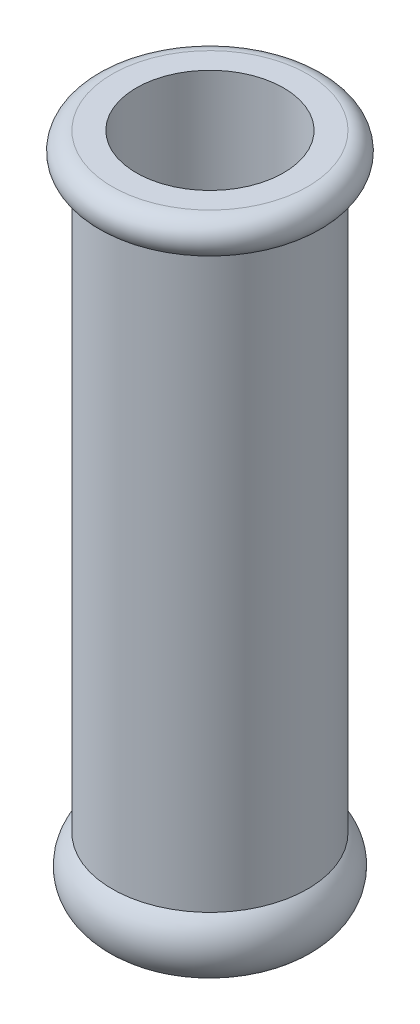
ISO-10303-21;
HEADER;
FILE_DESCRIPTION(('STEP AP214'),'2;1');
FILE_NAME('part.step','',(''),(''),'','','');
FILE_SCHEMA(('AUTOMOTIVE_DESIGN { 1 0 10303 214 1 1 1 1 }'));
ENDSEC;
DATA;
#1=APPLICATION_CONTEXT('core data for automotive mechanical design processes');
#2=APPLICATION_PROTOCOL_DEFINITION('international standard','automotive_design',2000,#1);
#3=PRODUCT_CONTEXT('',#1,'mechanical');
#4=PRODUCT('Part','Part','',(#3));
#5=PRODUCT_RELATED_PRODUCT_CATEGORY('part','',(#4));
#6=PRODUCT_DEFINITION_FORMATION('','',#4);
#7=PRODUCT_DEFINITION_CONTEXT('part definition',#1,'design');
#8=PRODUCT_DEFINITION('design','',#6,#7);
#9=PRODUCT_DEFINITION_SHAPE('','',#8);
#10=(LENGTH_UNIT() NAMED_UNIT(*) SI_UNIT(.MILLI.,.METRE.));
#11=(NAMED_UNIT(*) PLANE_ANGLE_UNIT() SI_UNIT($,.RADIAN.));
#12=(NAMED_UNIT(*) SI_UNIT($,.STERADIAN.) SOLID_ANGLE_UNIT());
#13=UNCERTAINTY_MEASURE_WITH_UNIT(LENGTH_MEASURE(1.E-05),#10,'distance_accuracy_value','');
#14=(GEOMETRIC_REPRESENTATION_CONTEXT(3) GLOBAL_UNCERTAINTY_ASSIGNED_CONTEXT((#13)) GLOBAL_UNIT_ASSIGNED_CONTEXT((#10,
#11,#12)) REPRESENTATION_CONTEXT('',''));
#15=CARTESIAN_POINT('',(0.,0.,0.));
#16=DIRECTION('',(0.,0.,1.));
#17=DIRECTION('',(1.,0.,0.));
#18=AXIS2_PLACEMENT_3D('',#15,#16,#17);
#19=CARTESIAN_POINT('',(-4.11000000000002,37.6,0.));
#20=DIRECTION('',(0.,-1.,0.));
#21=DIRECTION('',(0.,0.,-1.));
#22=AXIS2_PLACEMENT_3D('',#19,#20,#21);
#23=PLANE('',#22);
#24=CARTESIAN_POINT('',(0.,37.6,0.));
#25=DIRECTION('',(0.,-1.,0.));
#26=DIRECTION('',(0.,0.,-1.));
#27=AXIS2_PLACEMENT_3D('',#24,#25,#26);
#28=CIRCLE('',#27,5.45);
#29=CARTESIAN_POINT('',(0.,37.6,-5.45000000000002));
#30=VERTEX_POINT('',#29);
#31=EDGE_CURVE('E10',#30,#30,#28,.T.);
#32=ORIENTED_EDGE('',*,*,#31,.F.);
#33=EDGE_LOOP('',(#32));
#34=FACE_BOUND('',#33,.T.);
#35=CARTESIAN_POINT('',(0.,37.6,0.));
#36=DIRECTION('',(0.,-1.,0.));
#37=DIRECTION('',(0.,0.,-1.));
#38=AXIS2_PLACEMENT_3D('',#35,#36,#37);
#39=CIRCLE('',#38,4.11);
#40=CARTESIAN_POINT('',(0.,37.6,-4.11000000000002));
#41=VERTEX_POINT('',#40);
#42=EDGE_CURVE('E49',#41,#41,#39,.T.);
#43=ORIENTED_EDGE('',*,*,#42,.T.);
#44=EDGE_LOOP('',(#43));
#45=FACE_BOUND('',#44,.T.);
#46=ADVANCED_FACE('F30',(#34,#45),#23,.F.);
#47=CARTESIAN_POINT('',(0.,36.6,0.));
#48=DIRECTION('',(0.,-1.,0.));
#49=DIRECTION('',(0.,0.,-1.));
#50=AXIS2_PLACEMENT_3D('',#47,#48,#49);
#51=TOROIDAL_SURFACE('',#50,5.45,1.);
#52=CARTESIAN_POINT('',(0.,35.6,0.));
#53=DIRECTION('',(0.,-1.,0.));
#54=DIRECTION('',(0.,0.,-1.));
#55=AXIS2_PLACEMENT_3D('',#52,#53,#54);
#56=CIRCLE('',#55,5.45);
#57=CARTESIAN_POINT('',(0.,35.6,-5.45000000000002));
#58=VERTEX_POINT('',#57);
#59=EDGE_CURVE('E36',#58,#58,#56,.T.);
#60=ORIENTED_EDGE('',*,*,#59,.F.);
#61=EDGE_LOOP('',(#60));
#62=FACE_BOUND('',#61,.T.);
#63=ORIENTED_EDGE('',*,*,#31,.T.);
#64=EDGE_LOOP('',(#63));
#65=FACE_BOUND('',#64,.T.);
#66=ADVANCED_FACE('F68',(#62,#65),#51,.T.);
#67=CARTESIAN_POINT('',(0.,0.,0.));
#68=DIRECTION('',(0.,-1.,0.));
#69=DIRECTION('',(0.,0.,-1.));
#70=AXIS2_PLACEMENT_3D('',#67,#68,#69);
#71=CYLINDRICAL_SURFACE('',#70,5.45);
#72=CARTESIAN_POINT('',(0.,3.65617770100107,0.));
#73=DIRECTION('',(0.,-1.,0.));
#74=DIRECTION('',(0.,0.,-1.));
#75=AXIS2_PLACEMENT_3D('',#72,#73,#74);
#76=CIRCLE('',#75,5.45);
#77=CARTESIAN_POINT('',(0.,3.65617770100107,-5.45000000000002));
#78=VERTEX_POINT('',#77);
#79=EDGE_CURVE('E40',#78,#78,#76,.T.);
#80=ORIENTED_EDGE('',*,*,#79,.F.);
#81=EDGE_LOOP('',(#80));
#82=FACE_BOUND('',#81,.T.);
#83=ORIENTED_EDGE('',*,*,#59,.T.);
#84=EDGE_LOOP('',(#83));
#85=FACE_BOUND('',#84,.T.);
#86=ADVANCED_FACE('F63',(#82,#85),#71,.T.);
#87=CARTESIAN_POINT('',(0.,2.07364584291755,0.));
#88=DIRECTION('',(0.,-1.,0.));
#89=DIRECTION('',(0.,0.,-1.));
#90=AXIS2_PLACEMENT_3D('',#87,#88,#89);
#91=TOROIDAL_SURFACE('',#90,4.11,2.07364584291755);
#92=CARTESIAN_POINT('',(0.,0.,0.));
#93=DIRECTION('',(0.,-1.,0.));
#94=DIRECTION('',(0.,0.,-1.));
#95=AXIS2_PLACEMENT_3D('',#92,#93,#94);
#96=CIRCLE('',#95,4.11);
#97=CARTESIAN_POINT('',(0.,0.,-4.11000000000002));
#98=VERTEX_POINT('',#97);
#99=EDGE_CURVE('E44',#98,#98,#96,.T.);
#100=ORIENTED_EDGE('',*,*,#99,.F.);
#101=EDGE_LOOP('',(#100));
#102=FACE_BOUND('',#101,.T.);
#103=ORIENTED_EDGE('',*,*,#79,.T.);
#104=EDGE_LOOP('',(#103));
#105=FACE_BOUND('',#104,.T.);
#106=ADVANCED_FACE('F57',(#102,#105),#91,.T.);
#107=CARTESIAN_POINT('',(0.,0.,0.));
#108=DIRECTION('',(0.,-1.,0.));
#109=DIRECTION('',(0.,0.,-1.));
#110=AXIS2_PLACEMENT_3D('',#107,#108,#109);
#111=CYLINDRICAL_SURFACE('',#110,4.11);
#112=ORIENTED_EDGE('',*,*,#42,.F.);
#113=EDGE_LOOP('',(#112));
#114=FACE_BOUND('',#113,.T.);
#115=ORIENTED_EDGE('',*,*,#99,.T.);
#116=EDGE_LOOP('',(#115));
#117=FACE_BOUND('',#116,.T.);
#118=ADVANCED_FACE('F54',(#114,#117),#111,.F.);
#119=CLOSED_SHELL('',(#46,#66,#86,#106,#118));
#120=MANIFOLD_SOLID_BREP('B2',#119);
#121=ADVANCED_BREP_SHAPE_REPRESENTATION('',(#18,#120),#14);
#122=SHAPE_DEFINITION_REPRESENTATION(#9,#121);
ENDSEC;
END-ISO-10303-21;
